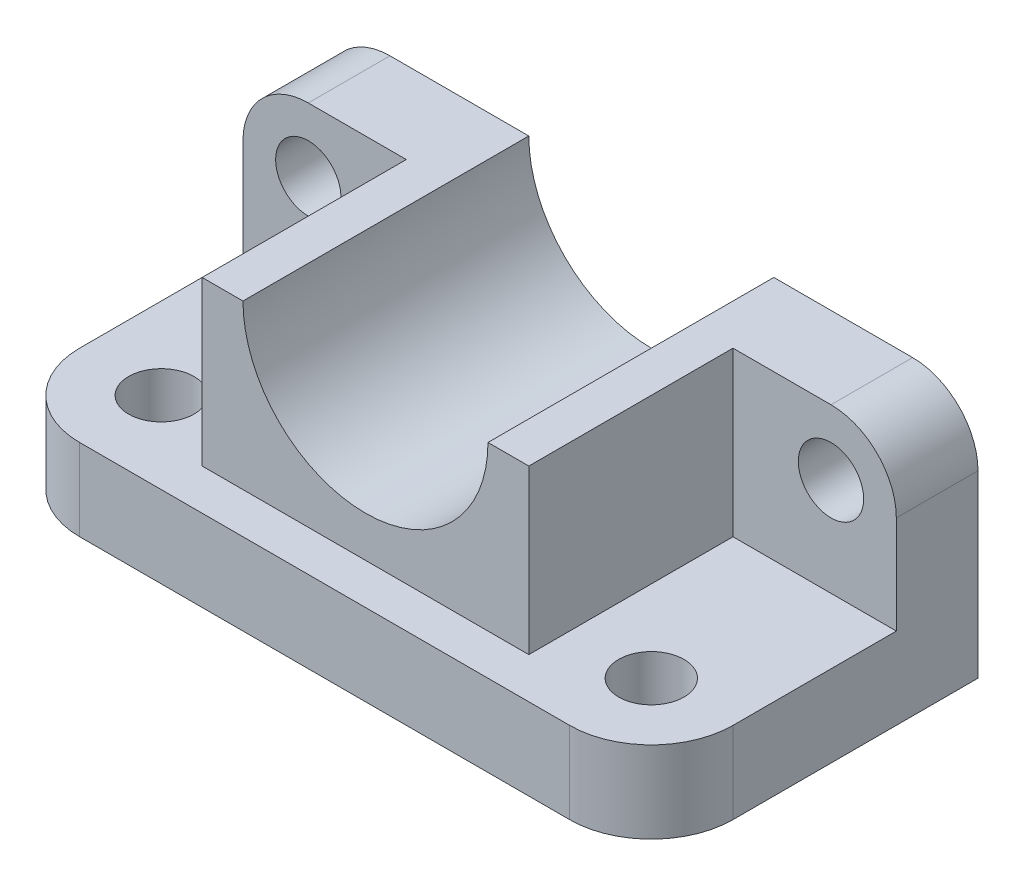
ISO-10303-21;
HEADER;
FILE_DESCRIPTION(('STEP AP214'),'2;1');
FILE_NAME('part.step','',(''),(''),'','','');
FILE_SCHEMA(('AUTOMOTIVE_DESIGN { 1 0 10303 214 1 1 1 1 }'));
ENDSEC;
DATA;
#1=APPLICATION_CONTEXT('core data for automotive mechanical design processes');
#2=APPLICATION_PROTOCOL_DEFINITION('international standard','automotive_design',2000,#1);
#3=PRODUCT_CONTEXT('',#1,'mechanical');
#4=PRODUCT('Part','Part','',(#3));
#5=PRODUCT_RELATED_PRODUCT_CATEGORY('part','',(#4));
#6=PRODUCT_DEFINITION_FORMATION('','',#4);
#7=PRODUCT_DEFINITION_CONTEXT('part definition',#1,'design');
#8=PRODUCT_DEFINITION('design','',#6,#7);
#9=PRODUCT_DEFINITION_SHAPE('','',#8);
#10=(LENGTH_UNIT() NAMED_UNIT(*) SI_UNIT(.MILLI.,.METRE.));
#11=(NAMED_UNIT(*) PLANE_ANGLE_UNIT() SI_UNIT($,.RADIAN.));
#12=(NAMED_UNIT(*) SI_UNIT($,.STERADIAN.) SOLID_ANGLE_UNIT());
#13=UNCERTAINTY_MEASURE_WITH_UNIT(LENGTH_MEASURE(1.E-05),#10,'distance_accuracy_value','');
#14=(GEOMETRIC_REPRESENTATION_CONTEXT(3) GLOBAL_UNCERTAINTY_ASSIGNED_CONTEXT((#13)) GLOBAL_UNIT_ASSIGNED_CONTEXT((#10,
#11,#12)) REPRESENTATION_CONTEXT('',''));
#15=CARTESIAN_POINT('',(0.,0.,0.));
#16=DIRECTION('',(0.,0.,1.));
#17=DIRECTION('',(1.,0.,0.));
#18=AXIS2_PLACEMENT_3D('',#15,#16,#17);
#19=CARTESIAN_POINT('',(0.,10.,0.));
#20=DIRECTION('',(0.,0.,-1.));
#21=DIRECTION('',(-1.,0.,0.));
#22=AXIS2_PLACEMENT_3D('',#19,#20,#21);
#23=PLANE('',#22);
#24=DIRECTION('',(1.,0.,0.));
#25=VECTOR('',#24,1.);
#26=CARTESIAN_POINT('',(0.,0.,0.));
#27=LINE('',#26,#25);
#28=CARTESIAN_POINT('',(-30.,0.,0.));
#29=VERTEX_POINT('',#28);
#30=CARTESIAN_POINT('',(30.,0.,0.));
#31=VERTEX_POINT('',#30);
#32=EDGE_CURVE('E262',#29,#31,#27,.T.);
#33=ORIENTED_EDGE('',*,*,#32,.T.);
#34=DIRECTION('',(0.,-1.,0.));
#35=VECTOR('',#34,1.);
#36=CARTESIAN_POINT('',(30.,10.,0.));
#37=LINE('',#36,#35);
#38=CARTESIAN_POINT('',(30.,10.,0.));
#39=VERTEX_POINT('',#38);
#40=EDGE_CURVE('E285',#31,#39,#37,.F.);
#41=ORIENTED_EDGE('',*,*,#40,.T.);
#42=DIRECTION('',(1.,0.,0.));
#43=VECTOR('',#42,1.);
#44=CARTESIAN_POINT('',(0.,10.,0.));
#45=LINE('',#44,#43);
#46=CARTESIAN_POINT('',(-30.,10.,0.));
#47=VERTEX_POINT('',#46);
#48=EDGE_CURVE('E268',#47,#39,#45,.T.);
#49=ORIENTED_EDGE('',*,*,#48,.F.);
#50=DIRECTION('',(0.,-1.,0.));
#51=VECTOR('',#50,1.);
#52=CARTESIAN_POINT('',(-30.,10.,0.));
#53=LINE('',#52,#51);
#54=EDGE_CURVE('E212',#29,#47,#53,.F.);
#55=ORIENTED_EDGE('',*,*,#54,.F.);
#56=EDGE_LOOP('',(#33,#41,#49,#55));
#57=FACE_BOUND('',#56,.T.);
#58=ADVANCED_FACE('F41',(#57),#23,.F.);
#59=CARTESIAN_POINT('',(40.,10.,0.));
#60=DIRECTION('',(-1.,0.,0.));
#61=DIRECTION('',(0.,0.,1.));
#62=AXIS2_PLACEMENT_3D('',#59,#60,#61);
#63=PLANE('',#62);
#64=DIRECTION('',(0.,-1.,0.));
#65=VECTOR('',#64,1.);
#66=CARTESIAN_POINT('',(40.,30.,-40.));
#67=LINE('',#66,#65);
#68=CARTESIAN_POINT('',(40.,22.,-40.));
#69=VERTEX_POINT('',#68);
#70=CARTESIAN_POINT('',(40.,0.,-40.));
#71=VERTEX_POINT('',#70);
#72=EDGE_CURVE('E250',#69,#71,#67,.T.);
#73=ORIENTED_EDGE('',*,*,#72,.F.);
#74=DIRECTION('',(0.,0.,-1.));
#75=VECTOR('',#74,1.);
#76=CARTESIAN_POINT('',(40.,22.,-30.));
#77=LINE('',#76,#75);
#78=CARTESIAN_POINT('',(40.,22.,-30.));
#79=VERTEX_POINT('',#78);
#80=EDGE_CURVE('E49',#69,#79,#77,.F.);
#81=ORIENTED_EDGE('',*,*,#80,.T.);
#82=DIRECTION('',(0.,-1.,0.));
#83=VECTOR('',#82,1.);
#84=CARTESIAN_POINT('',(40.,30.,-30.));
#85=LINE('',#84,#83);
#86=CARTESIAN_POINT('',(40.,10.,-30.));
#87=VERTEX_POINT('',#86);
#88=EDGE_CURVE('E254',#79,#87,#85,.T.);
#89=ORIENTED_EDGE('',*,*,#88,.T.);
#90=DIRECTION('',(0.,0.,-1.));
#91=VECTOR('',#90,1.);
#92=CARTESIAN_POINT('',(40.,10.,0.));
#93=LINE('',#92,#91);
#94=CARTESIAN_POINT('',(40.,10.,-10.));
#95=VERTEX_POINT('',#94);
#96=EDGE_CURVE('E271',#95,#87,#93,.T.);
#97=ORIENTED_EDGE('',*,*,#96,.F.);
#98=DIRECTION('',(0.,-1.,0.));
#99=VECTOR('',#98,1.);
#100=CARTESIAN_POINT('',(40.,10.,-10.));
#101=LINE('',#100,#99);
#102=CARTESIAN_POINT('',(40.,0.,-10.));
#103=VERTEX_POINT('',#102);
#104=EDGE_CURVE('E276',#95,#103,#101,.T.);
#105=ORIENTED_EDGE('',*,*,#104,.T.);
#106=DIRECTION('',(0.,0.,-1.));
#107=VECTOR('',#106,1.);
#108=CARTESIAN_POINT('',(40.,0.,0.));
#109=LINE('',#108,#107);
#110=EDGE_CURVE('E266',#103,#71,#109,.T.);
#111=ORIENTED_EDGE('',*,*,#110,.T.);
#112=EDGE_LOOP('',(#73,#81,#89,#97,#105,#111));
#113=FACE_BOUND('',#112,.T.);
#114=ADVANCED_FACE('F304',(#113),#63,.F.);
#115=CARTESIAN_POINT('',(0.,10.,0.));
#116=DIRECTION('',(0.,1.,0.));
#117=DIRECTION('',(0.,0.,1.));
#118=AXIS2_PLACEMENT_3D('',#115,#116,#117);
#119=PLANE('',#118);
#120=CARTESIAN_POINT('',(30.,10.,-10.));
#121=DIRECTION('',(0.,1.,0.));
#122=DIRECTION('',(0.,0.,1.));
#123=AXIS2_PLACEMENT_3D('',#120,#121,#122);
#124=CIRCLE('',#123,4.00000000000001);
#125=CARTESIAN_POINT('',(30.,10.,-5.99999999999999));
#126=VERTEX_POINT('',#125);
#127=EDGE_CURVE('E230',#126,#126,#124,.T.);
#128=ORIENTED_EDGE('',*,*,#127,.F.);
#129=EDGE_LOOP('',(#128));
#130=FACE_BOUND('',#129,.T.);
#131=ORIENTED_EDGE('',*,*,#48,.T.);
#132=CARTESIAN_POINT('',(30.,10.,-10.));
#133=DIRECTION('',(0.,1.,0.));
#134=DIRECTION('',(0.,0.,1.));
#135=AXIS2_PLACEMENT_3D('',#132,#133,#134);
#136=CIRCLE('',#135,10.);
#137=EDGE_CURVE('E287',#39,#95,#136,.T.);
#138=ORIENTED_EDGE('',*,*,#137,.T.);
#139=ORIENTED_EDGE('',*,*,#96,.T.);
#140=DIRECTION('',(-1.,0.,0.));
#141=VECTOR('',#140,1.);
#142=CARTESIAN_POINT('',(0.,10.,-30.));
#143=LINE('',#142,#141);
#144=CARTESIAN_POINT('',(20.,10.,-30.));
#145=VERTEX_POINT('',#144);
#146=EDGE_CURVE('E274',#87,#145,#143,.T.);
#147=ORIENTED_EDGE('',*,*,#146,.T.);
#148=DIRECTION('',(0.,0.,1.));
#149=VECTOR('',#148,1.);
#150=CARTESIAN_POINT('',(20.,10.,0.));
#151=LINE('',#150,#149);
#152=CARTESIAN_POINT('',(20.,10.,-5.));
#153=VERTEX_POINT('',#152);
#154=EDGE_CURVE('E263',#145,#153,#151,.T.);
#155=ORIENTED_EDGE('',*,*,#154,.T.);
#156=DIRECTION('',(-1.,0.,0.));
#157=VECTOR('',#156,1.);
#158=CARTESIAN_POINT('',(0.,10.,-5.));
#159=LINE('',#158,#157);
#160=CARTESIAN_POINT('',(-20.,10.,-5.));
#161=VERTEX_POINT('',#160);
#162=EDGE_CURVE('E265',#153,#161,#159,.T.);
#163=ORIENTED_EDGE('',*,*,#162,.T.);
#164=DIRECTION('',(0.,0.,1.));
#165=VECTOR('',#164,1.);
#166=CARTESIAN_POINT('',(-20.,10.,0.));
#167=LINE('',#166,#165);
#168=CARTESIAN_POINT('',(-20.,10.,-30.));
#169=VERTEX_POINT('',#168);
#170=EDGE_CURVE('E195',#169,#161,#167,.T.);
#171=ORIENTED_EDGE('',*,*,#170,.F.);
#172=DIRECTION('',(1.,0.,0.));
#173=VECTOR('',#172,1.);
#174=CARTESIAN_POINT('',(0.,10.,-30.));
#175=LINE('',#174,#173);
#176=CARTESIAN_POINT('',(-40.,10.,-30.));
#177=VERTEX_POINT('',#176);
#178=EDGE_CURVE('E201',#177,#169,#175,.T.);
#179=ORIENTED_EDGE('',*,*,#178,.F.);
#180=DIRECTION('',(0.,0.,-1.));
#181=VECTOR('',#180,1.);
#182=CARTESIAN_POINT('',(-40.,10.,0.));
#183=LINE('',#182,#181);
#184=CARTESIAN_POINT('',(-40.,10.,-10.));
#185=VERTEX_POINT('',#184);
#186=EDGE_CURVE('E198',#185,#177,#183,.T.);
#187=ORIENTED_EDGE('',*,*,#186,.F.);
#188=CARTESIAN_POINT('',(-30.,10.,-10.));
#189=DIRECTION('',(0.,-1.,0.));
#190=DIRECTION('',(0.,0.,1.));
#191=AXIS2_PLACEMENT_3D('',#188,#189,#190);
#192=CIRCLE('',#191,10.);
#193=EDGE_CURVE('E215',#47,#185,#192,.T.);
#194=ORIENTED_EDGE('',*,*,#193,.F.);
#195=EDGE_LOOP('',(#131,#138,#139,#147,#155,#163,#171,#179,#187,#194));
#196=FACE_BOUND('',#195,.T.);
#197=CARTESIAN_POINT('',(-30.,10.,-10.));
#198=DIRECTION('',(0.,-1.,0.));
#199=DIRECTION('',(0.,0.,1.));
#200=AXIS2_PLACEMENT_3D('',#197,#198,#199);
#201=CIRCLE('',#200,4.00000000000001);
#202=CARTESIAN_POINT('',(-30.,10.,-5.99999999999999));
#203=VERTEX_POINT('',#202);
#204=EDGE_CURVE('E340',#203,#203,#201,.T.);
#205=ORIENTED_EDGE('',*,*,#204,.T.);
#206=EDGE_LOOP('',(#205));
#207=FACE_BOUND('',#206,.T.);
#208=ADVANCED_FACE('F307',(#130,#196,#207),#119,.T.);
#209=CARTESIAN_POINT('',(0.,0.,0.));
#210=DIRECTION('',(0.,1.,0.));
#211=DIRECTION('',(0.,0.,1.));
#212=AXIS2_PLACEMENT_3D('',#209,#210,#211);
#213=PLANE('',#212);
#214=CARTESIAN_POINT('',(30.,0.,-10.));
#215=DIRECTION('',(0.,1.,0.));
#216=DIRECTION('',(0.,0.,1.));
#217=AXIS2_PLACEMENT_3D('',#214,#215,#216);
#218=CIRCLE('',#217,4.00000000000001);
#219=CARTESIAN_POINT('',(30.,0.,-5.99999999999999));
#220=VERTEX_POINT('',#219);
#221=EDGE_CURVE('E162',#220,#220,#218,.F.);
#222=ORIENTED_EDGE('',*,*,#221,.F.);
#223=EDGE_LOOP('',(#222));
#224=FACE_BOUND('',#223,.T.);
#225=ORIENTED_EDGE('',*,*,#110,.F.);
#226=CARTESIAN_POINT('',(30.,0.,-10.));
#227=DIRECTION('',(0.,1.,0.));
#228=DIRECTION('',(0.,0.,1.));
#229=AXIS2_PLACEMENT_3D('',#226,#227,#228);
#230=CIRCLE('',#229,10.);
#231=EDGE_CURVE('E283',#103,#31,#230,.F.);
#232=ORIENTED_EDGE('',*,*,#231,.T.);
#233=ORIENTED_EDGE('',*,*,#32,.F.);
#234=CARTESIAN_POINT('',(-30.,0.,-10.));
#235=DIRECTION('',(0.,-1.,0.));
#236=DIRECTION('',(0.,0.,1.));
#237=AXIS2_PLACEMENT_3D('',#234,#235,#236);
#238=CIRCLE('',#237,10.);
#239=CARTESIAN_POINT('',(-40.,0.,-10.));
#240=VERTEX_POINT('',#239);
#241=EDGE_CURVE('E209',#240,#29,#238,.F.);
#242=ORIENTED_EDGE('',*,*,#241,.F.);
#243=DIRECTION('',(0.,0.,-1.));
#244=VECTOR('',#243,1.);
#245=CARTESIAN_POINT('',(-40.,0.,0.));
#246=LINE('',#245,#244);
#247=CARTESIAN_POINT('',(-40.,0.,-40.));
#248=VERTEX_POINT('',#247);
#249=EDGE_CURVE('E194',#240,#248,#246,.T.);
#250=ORIENTED_EDGE('',*,*,#249,.T.);
#251=DIRECTION('',(1.,0.,0.));
#252=VECTOR('',#251,1.);
#253=CARTESIAN_POINT('',(0.,0.,-40.));
#254=LINE('',#253,#252);
#255=EDGE_CURVE('E239',#248,#71,#254,.T.);
#256=ORIENTED_EDGE('',*,*,#255,.T.);
#257=EDGE_LOOP('',(#225,#232,#233,#242,#250,#256));
#258=FACE_BOUND('',#257,.T.);
#259=CARTESIAN_POINT('',(-30.,0.,-10.));
#260=DIRECTION('',(0.,-1.,0.));
#261=DIRECTION('',(0.,0.,1.));
#262=AXIS2_PLACEMENT_3D('',#259,#260,#261);
#263=CIRCLE('',#262,4.00000000000001);
#264=CARTESIAN_POINT('',(-30.,0.,-5.99999999999999));
#265=VERTEX_POINT('',#264);
#266=EDGE_CURVE('E170',#265,#265,#263,.F.);
#267=ORIENTED_EDGE('',*,*,#266,.T.);
#268=EDGE_LOOP('',(#267));
#269=FACE_BOUND('',#268,.T.);
#270=ADVANCED_FACE('F317',(#224,#258,#269),#213,.F.);
#271=CARTESIAN_POINT('',(0.,30.,-5.));
#272=DIRECTION('',(0.,0.,1.));
#273=DIRECTION('',(1.,0.,0.));
#274=AXIS2_PLACEMENT_3D('',#271,#272,#273);
#275=PLANE('',#274);
#276=CARTESIAN_POINT('',(0.,30.,-5.));
#277=DIRECTION('',(0.,0.,1.));
#278=DIRECTION('',(-1.,0.,0.));
#279=AXIS2_PLACEMENT_3D('',#276,#277,#278);
#280=CIRCLE('',#279,15.);
#281=CARTESIAN_POINT('',(-15.,30.,-5.));
#282=VERTEX_POINT('',#281);
#283=CARTESIAN_POINT('',(15.,30.,-5.));
#284=VERTEX_POINT('',#283);
#285=EDGE_CURVE('E161',#282,#284,#280,.T.);
#286=ORIENTED_EDGE('',*,*,#285,.F.);
#287=DIRECTION('',(1.,0.,0.));
#288=VECTOR('',#287,1.);
#289=CARTESIAN_POINT('',(0.,30.,-5.));
#290=LINE('',#289,#288);
#291=CARTESIAN_POINT('',(-20.,30.,-5.));
#292=VERTEX_POINT('',#291);
#293=EDGE_CURVE('E169',#292,#282,#290,.T.);
#294=ORIENTED_EDGE('',*,*,#293,.F.);
#295=DIRECTION('',(0.,-1.,0.));
#296=VECTOR('',#295,1.);
#297=CARTESIAN_POINT('',(-20.,30.,-5.));
#298=LINE('',#297,#296);
#299=EDGE_CURVE('E191',#292,#161,#298,.T.);
#300=ORIENTED_EDGE('',*,*,#299,.T.);
#301=ORIENTED_EDGE('',*,*,#162,.F.);
#302=DIRECTION('',(0.,-1.,0.));
#303=VECTOR('',#302,1.);
#304=CARTESIAN_POINT('',(20.,30.,-5.));
#305=LINE('',#304,#303);
#306=CARTESIAN_POINT('',(20.,30.,-5.));
#307=VERTEX_POINT('',#306);
#308=EDGE_CURVE('E259',#307,#153,#305,.T.);
#309=ORIENTED_EDGE('',*,*,#308,.F.);
#310=DIRECTION('',(-1.,0.,0.));
#311=VECTOR('',#310,1.);
#312=CARTESIAN_POINT('',(0.,30.,-5.));
#313=LINE('',#312,#311);
#314=EDGE_CURVE('E240',#307,#284,#313,.T.);
#315=ORIENTED_EDGE('',*,*,#314,.T.);
#316=EDGE_LOOP('',(#286,#294,#300,#301,#309,#315));
#317=FACE_BOUND('',#316,.T.);
#318=ADVANCED_FACE('F400',(#317),#275,.T.);
#319=CARTESIAN_POINT('',(20.,30.,0.));
#320=DIRECTION('',(1.,0.,0.));
#321=DIRECTION('',(0.,0.,-1.));
#322=AXIS2_PLACEMENT_3D('',#319,#320,#321);
#323=PLANE('',#322);
#324=ORIENTED_EDGE('',*,*,#308,.T.);
#325=ORIENTED_EDGE('',*,*,#154,.F.);
#326=DIRECTION('',(0.,-1.,0.));
#327=VECTOR('',#326,1.);
#328=CARTESIAN_POINT('',(20.,30.,-30.));
#329=LINE('',#328,#327);
#330=CARTESIAN_POINT('',(20.,30.,-30.));
#331=VERTEX_POINT('',#330);
#332=EDGE_CURVE('E256',#331,#145,#329,.T.);
#333=ORIENTED_EDGE('',*,*,#332,.F.);
#334=DIRECTION('',(0.,0.,1.));
#335=VECTOR('',#334,1.);
#336=CARTESIAN_POINT('',(20.,30.,0.));
#337=LINE('',#336,#335);
#338=EDGE_CURVE('E243',#331,#307,#337,.T.);
#339=ORIENTED_EDGE('',*,*,#338,.T.);
#340=EDGE_LOOP('',(#324,#325,#333,#339));
#341=FACE_BOUND('',#340,.T.);
#342=ADVANCED_FACE('F396',(#341),#323,.T.);
#343=CARTESIAN_POINT('',(0.,30.,-30.));
#344=DIRECTION('',(0.,0.,1.));
#345=DIRECTION('',(1.,0.,0.));
#346=AXIS2_PLACEMENT_3D('',#343,#344,#345);
#347=PLANE('',#346);
#348=CARTESIAN_POINT('',(32.,22.,-30.));
#349=DIRECTION('',(0.,0.,1.));
#350=DIRECTION('',(1.,0.,0.));
#351=AXIS2_PLACEMENT_3D('',#348,#349,#350);
#352=CIRCLE('',#351,4.);
#353=CARTESIAN_POINT('',(36.,22.,-30.));
#354=VERTEX_POINT('',#353);
#355=EDGE_CURVE('E227',#354,#354,#352,.T.);
#356=ORIENTED_EDGE('',*,*,#355,.F.);
#357=EDGE_LOOP('',(#356));
#358=FACE_BOUND('',#357,.T.);
#359=ORIENTED_EDGE('',*,*,#88,.F.);
#360=CARTESIAN_POINT('',(32.,22.,-30.));
#361=DIRECTION('',(0.,0.,1.));
#362=DIRECTION('',(1.,0.,0.));
#363=AXIS2_PLACEMENT_3D('',#360,#361,#362);
#364=CIRCLE('',#363,8.);
#365=CARTESIAN_POINT('',(32.,30.,-30.));
#366=VERTEX_POINT('',#365);
#367=EDGE_CURVE('E11',#79,#366,#364,.T.);
#368=ORIENTED_EDGE('',*,*,#367,.T.);
#369=DIRECTION('',(-1.,0.,0.));
#370=VECTOR('',#369,1.);
#371=CARTESIAN_POINT('',(0.,30.,-30.));
#372=LINE('',#371,#370);
#373=EDGE_CURVE('E246',#366,#331,#372,.T.);
#374=ORIENTED_EDGE('',*,*,#373,.T.);
#375=ORIENTED_EDGE('',*,*,#332,.T.);
#376=ORIENTED_EDGE('',*,*,#146,.F.);
#377=EDGE_LOOP('',(#359,#368,#374,#375,#376));
#378=FACE_BOUND('',#377,.T.);
#379=ADVANCED_FACE('F300',(#358,#378),#347,.T.);
#380=CARTESIAN_POINT('',(0.,30.,-40.));
#381=DIRECTION('',(0.,0.,-1.));
#382=DIRECTION('',(-1.,0.,0.));
#383=AXIS2_PLACEMENT_3D('',#380,#381,#382);
#384=PLANE('',#383);
#385=CARTESIAN_POINT('',(32.,22.,-40.));
#386=DIRECTION('',(0.,0.,-1.));
#387=DIRECTION('',(-1.,0.,0.));
#388=AXIS2_PLACEMENT_3D('',#385,#386,#387);
#389=CIRCLE('',#388,4.);
#390=CARTESIAN_POINT('',(28.,22.,-40.));
#391=VERTEX_POINT('',#390);
#392=EDGE_CURVE('E226',#391,#391,#389,.F.);
#393=ORIENTED_EDGE('',*,*,#392,.T.);
#394=EDGE_LOOP('',(#393));
#395=FACE_BOUND('',#394,.T.);
#396=DIRECTION('',(1.,0.,0.));
#397=VECTOR('',#396,1.);
#398=CARTESIAN_POINT('',(0.,30.,-40.));
#399=LINE('',#398,#397);
#400=CARTESIAN_POINT('',(15.,30.,-40.));
#401=VERTEX_POINT('',#400);
#402=CARTESIAN_POINT('',(32.,30.,-40.));
#403=VERTEX_POINT('',#402);
#404=EDGE_CURVE('E248',#401,#403,#399,.T.);
#405=ORIENTED_EDGE('',*,*,#404,.T.);
#406=CARTESIAN_POINT('',(32.,22.,-40.));
#407=DIRECTION('',(0.,0.,-1.));
#408=DIRECTION('',(-1.,0.,0.));
#409=AXIS2_PLACEMENT_3D('',#406,#407,#408);
#410=CIRCLE('',#409,8.);
#411=EDGE_CURVE('E63',#403,#69,#410,.T.);
#412=ORIENTED_EDGE('',*,*,#411,.T.);
#413=ORIENTED_EDGE('',*,*,#72,.T.);
#414=ORIENTED_EDGE('',*,*,#255,.F.);
#415=DIRECTION('',(0.,-1.,0.));
#416=VECTOR('',#415,1.);
#417=CARTESIAN_POINT('',(-40.,30.,-40.));
#418=LINE('',#417,#416);
#419=CARTESIAN_POINT('',(-40.,22.,-40.));
#420=VERTEX_POINT('',#419);
#421=EDGE_CURVE('E177',#420,#248,#418,.T.);
#422=ORIENTED_EDGE('',*,*,#421,.F.);
#423=CARTESIAN_POINT('',(-32.,22.,-40.));
#424=DIRECTION('',(0.,0.,1.));
#425=DIRECTION('',(1.,0.,0.));
#426=AXIS2_PLACEMENT_3D('',#423,#424,#425);
#427=CIRCLE('',#426,8.);
#428=CARTESIAN_POINT('',(-32.,30.,-40.));
#429=VERTEX_POINT('',#428);
#430=EDGE_CURVE('E176',#429,#420,#427,.T.);
#431=ORIENTED_EDGE('',*,*,#430,.F.);
#432=DIRECTION('',(-1.,0.,0.));
#433=VECTOR('',#432,1.);
#434=CARTESIAN_POINT('',(0.,30.,-40.));
#435=LINE('',#434,#433);
#436=CARTESIAN_POINT('',(-15.,30.,-40.));
#437=VERTEX_POINT('',#436);
#438=EDGE_CURVE('E167',#437,#429,#435,.T.);
#439=ORIENTED_EDGE('',*,*,#438,.F.);
#440=CARTESIAN_POINT('',(0.,30.,-40.));
#441=DIRECTION('',(0.,0.,-1.));
#442=DIRECTION('',(-1.,0.,0.));
#443=AXIS2_PLACEMENT_3D('',#440,#441,#442);
#444=CIRCLE('',#443,15.);
#445=EDGE_CURVE('E152',#437,#401,#444,.F.);
#446=ORIENTED_EDGE('',*,*,#445,.T.);
#447=EDGE_LOOP('',(#405,#412,#413,#414,#422,#431,#439,#446));
#448=FACE_BOUND('',#447,.T.);
#449=CARTESIAN_POINT('',(-32.,22.,-40.));
#450=DIRECTION('',(0.,0.,1.));
#451=DIRECTION('',(1.,0.,0.));
#452=AXIS2_PLACEMENT_3D('',#449,#450,#451);
#453=CIRCLE('',#452,4.);
#454=CARTESIAN_POINT('',(-28.,22.,-40.));
#455=VERTEX_POINT('',#454);
#456=EDGE_CURVE('E344',#455,#455,#453,.F.);
#457=ORIENTED_EDGE('',*,*,#456,.F.);
#458=EDGE_LOOP('',(#457));
#459=FACE_BOUND('',#458,.T.);
#460=ADVANCED_FACE('F173',(#395,#448,#459),#384,.T.);
#461=CARTESIAN_POINT('',(0.,30.,0.));
#462=DIRECTION('',(0.,1.,0.));
#463=DIRECTION('',(0.,0.,1.));
#464=AXIS2_PLACEMENT_3D('',#461,#462,#463);
#465=PLANE('',#464);
#466=ORIENTED_EDGE('',*,*,#373,.F.);
#467=DIRECTION('',(0.,0.,-1.));
#468=VECTOR('',#467,1.);
#469=CARTESIAN_POINT('',(32.,30.,-40.));
#470=LINE('',#469,#468);
#471=EDGE_CURVE('E289',#366,#403,#470,.T.);
#472=ORIENTED_EDGE('',*,*,#471,.T.);
#473=ORIENTED_EDGE('',*,*,#404,.F.);
#474=DIRECTION('',(0.,0.,1.));
#475=VECTOR('',#474,1.);
#476=CARTESIAN_POINT('',(15.,30.,-40.001));
#477=LINE('',#476,#475);
#478=EDGE_CURVE('E158',#401,#284,#477,.T.);
#479=ORIENTED_EDGE('',*,*,#478,.T.);
#480=ORIENTED_EDGE('',*,*,#314,.F.);
#481=ORIENTED_EDGE('',*,*,#338,.F.);
#482=EDGE_LOOP('',(#466,#472,#473,#479,#480,#481));
#483=FACE_BOUND('',#482,.T.);
#484=ADVANCED_FACE('F295',(#483),#465,.T.);
#485=CARTESIAN_POINT('',(0.,30.,-40.001));
#486=DIRECTION('',(0.,0.,1.));
#487=DIRECTION('',(1.,0.,0.));
#488=AXIS2_PLACEMENT_3D('',#485,#486,#487);
#489=CYLINDRICAL_SURFACE('',#488,15.);
#490=ORIENTED_EDGE('',*,*,#445,.F.);
#491=DIRECTION('',(0.,0.,1.));
#492=VECTOR('',#491,1.);
#493=CARTESIAN_POINT('',(-15.,30.,-40.001));
#494=LINE('',#493,#492);
#495=EDGE_CURVE('E155',#437,#282,#494,.T.);
#496=ORIENTED_EDGE('',*,*,#495,.T.);
#497=ORIENTED_EDGE('',*,*,#285,.T.);
#498=ORIENTED_EDGE('',*,*,#478,.F.);
#499=EDGE_LOOP('',(#490,#496,#497,#498));
#500=FACE_BOUND('',#499,.T.);
#501=ADVANCED_FACE('F154',(#500),#489,.F.);
#502=CARTESIAN_POINT('',(30.,-0.000999999999999265,-10.));
#503=DIRECTION('',(0.,1.,0.));
#504=DIRECTION('',(0.,0.,1.));
#505=AXIS2_PLACEMENT_3D('',#502,#503,#504);
#506=CYLINDRICAL_SURFACE('',#505,4.00000000000001);
#507=ORIENTED_EDGE('',*,*,#127,.T.);
#508=EDGE_LOOP('',(#507));
#509=FACE_BOUND('',#508,.T.);
#510=ORIENTED_EDGE('',*,*,#221,.T.);
#511=EDGE_LOOP('',(#510));
#512=FACE_BOUND('',#511,.T.);
#513=ADVANCED_FACE('F372',(#509,#512),#506,.F.);
#514=CARTESIAN_POINT('',(30.,10.,-10.));
#515=DIRECTION('',(0.,-1.,0.));
#516=DIRECTION('',(0.,0.,-1.));
#517=AXIS2_PLACEMENT_3D('',#514,#515,#516);
#518=CYLINDRICAL_SURFACE('',#517,10.);
#519=ORIENTED_EDGE('',*,*,#137,.F.);
#520=ORIENTED_EDGE('',*,*,#40,.F.);
#521=ORIENTED_EDGE('',*,*,#231,.F.);
#522=ORIENTED_EDGE('',*,*,#104,.F.);
#523=EDGE_LOOP('',(#519,#520,#521,#522));
#524=FACE_BOUND('',#523,.T.);
#525=ADVANCED_FACE('F314',(#524),#518,.T.);
#526=CARTESIAN_POINT('',(32.,22.,0.));
#527=DIRECTION('',(0.,0.,1.));
#528=DIRECTION('',(1.,0.,0.));
#529=AXIS2_PLACEMENT_3D('',#526,#527,#528);
#530=CYLINDRICAL_SURFACE('',#529,8.);
#531=ORIENTED_EDGE('',*,*,#367,.F.);
#532=ORIENTED_EDGE('',*,*,#80,.F.);
#533=ORIENTED_EDGE('',*,*,#411,.F.);
#534=ORIENTED_EDGE('',*,*,#471,.F.);
#535=EDGE_LOOP('',(#531,#532,#533,#534));
#536=FACE_BOUND('',#535,.T.);
#537=ADVANCED_FACE('F43',(#536),#530,.T.);
#538=CARTESIAN_POINT('',(32.,22.,-40.001));
#539=DIRECTION('',(0.,0.,1.));
#540=DIRECTION('',(1.,0.,0.));
#541=AXIS2_PLACEMENT_3D('',#538,#539,#540);
#542=CYLINDRICAL_SURFACE('',#541,4.);
#543=ORIENTED_EDGE('',*,*,#392,.F.);
#544=EDGE_LOOP('',(#543));
#545=FACE_BOUND('',#544,.T.);
#546=ORIENTED_EDGE('',*,*,#355,.T.);
#547=EDGE_LOOP('',(#546));
#548=FACE_BOUND('',#547,.T.);
#549=ADVANCED_FACE('F377',(#545,#548),#542,.F.);
#550=CARTESIAN_POINT('',(-40.,10.,0.));
#551=DIRECTION('',(1.,0.,0.));
#552=DIRECTION('',(0.,0.,1.));
#553=AXIS2_PLACEMENT_3D('',#550,#551,#552);
#554=PLANE('',#553);
#555=ORIENTED_EDGE('',*,*,#421,.T.);
#556=ORIENTED_EDGE('',*,*,#249,.F.);
#557=DIRECTION('',(0.,-1.,0.));
#558=VECTOR('',#557,1.);
#559=CARTESIAN_POINT('',(-40.,10.,-10.));
#560=LINE('',#559,#558);
#561=EDGE_CURVE('E204',#185,#240,#560,.T.);
#562=ORIENTED_EDGE('',*,*,#561,.F.);
#563=ORIENTED_EDGE('',*,*,#186,.T.);
#564=DIRECTION('',(0.,-1.,0.));
#565=VECTOR('',#564,1.);
#566=CARTESIAN_POINT('',(-40.,30.,-30.));
#567=LINE('',#566,#565);
#568=CARTESIAN_POINT('',(-40.,22.,-30.));
#569=VERTEX_POINT('',#568);
#570=EDGE_CURVE('E181',#569,#177,#567,.T.);
#571=ORIENTED_EDGE('',*,*,#570,.F.);
#572=DIRECTION('',(0.,0.,-1.));
#573=VECTOR('',#572,1.);
#574=CARTESIAN_POINT('',(-40.,22.,-30.));
#575=LINE('',#574,#573);
#576=EDGE_CURVE('E220',#420,#569,#575,.F.);
#577=ORIENTED_EDGE('',*,*,#576,.F.);
#578=EDGE_LOOP('',(#555,#556,#562,#563,#571,#577));
#579=FACE_BOUND('',#578,.T.);
#580=ADVANCED_FACE('F322',(#579),#554,.F.);
#581=CARTESIAN_POINT('',(-20.,30.,0.));
#582=DIRECTION('',(-1.,0.,0.));
#583=DIRECTION('',(0.,0.,-1.));
#584=AXIS2_PLACEMENT_3D('',#581,#582,#583);
#585=PLANE('',#584);
#586=ORIENTED_EDGE('',*,*,#299,.F.);
#587=DIRECTION('',(0.,0.,1.));
#588=VECTOR('',#587,1.);
#589=CARTESIAN_POINT('',(-20.,30.,0.));
#590=LINE('',#589,#588);
#591=CARTESIAN_POINT('',(-20.,30.,-30.));
#592=VERTEX_POINT('',#591);
#593=EDGE_CURVE('E183',#592,#292,#590,.T.);
#594=ORIENTED_EDGE('',*,*,#593,.F.);
#595=DIRECTION('',(0.,-1.,0.));
#596=VECTOR('',#595,1.);
#597=CARTESIAN_POINT('',(-20.,30.,-30.));
#598=LINE('',#597,#596);
#599=EDGE_CURVE('E189',#592,#169,#598,.T.);
#600=ORIENTED_EDGE('',*,*,#599,.T.);
#601=ORIENTED_EDGE('',*,*,#170,.T.);
#602=EDGE_LOOP('',(#586,#594,#600,#601));
#603=FACE_BOUND('',#602,.T.);
#604=ADVANCED_FACE('F335',(#603),#585,.T.);
#605=CARTESIAN_POINT('',(0.,30.,-30.));
#606=DIRECTION('',(0.,0.,1.));
#607=DIRECTION('',(-1.,0.,0.));
#608=AXIS2_PLACEMENT_3D('',#605,#606,#607);
#609=PLANE('',#608);
#610=CARTESIAN_POINT('',(-32.,22.,-30.));
#611=DIRECTION('',(0.,0.,-1.));
#612=DIRECTION('',(-1.,0.,0.));
#613=AXIS2_PLACEMENT_3D('',#610,#611,#612);
#614=CIRCLE('',#613,4.);
#615=CARTESIAN_POINT('',(-36.,22.,-30.));
#616=VERTEX_POINT('',#615);
#617=EDGE_CURVE('E343',#616,#616,#614,.T.);
#618=ORIENTED_EDGE('',*,*,#617,.T.);
#619=EDGE_LOOP('',(#618));
#620=FACE_BOUND('',#619,.T.);
#621=ORIENTED_EDGE('',*,*,#570,.T.);
#622=ORIENTED_EDGE('',*,*,#178,.T.);
#623=ORIENTED_EDGE('',*,*,#599,.F.);
#624=DIRECTION('',(1.,0.,0.));
#625=VECTOR('',#624,1.);
#626=CARTESIAN_POINT('',(0.,30.,-30.));
#627=LINE('',#626,#625);
#628=CARTESIAN_POINT('',(-32.,30.,-30.));
#629=VERTEX_POINT('',#628);
#630=EDGE_CURVE('E178',#629,#592,#627,.T.);
#631=ORIENTED_EDGE('',*,*,#630,.F.);
#632=CARTESIAN_POINT('',(-32.,22.,-30.));
#633=DIRECTION('',(0.,0.,-1.));
#634=DIRECTION('',(-1.,0.,0.));
#635=AXIS2_PLACEMENT_3D('',#632,#633,#634);
#636=CIRCLE('',#635,8.);
#637=EDGE_CURVE('E223',#569,#629,#636,.T.);
#638=ORIENTED_EDGE('',*,*,#637,.F.);
#639=EDGE_LOOP('',(#621,#622,#623,#631,#638));
#640=FACE_BOUND('',#639,.T.);
#641=ADVANCED_FACE('F332',(#620,#640),#609,.T.);
#642=CARTESIAN_POINT('',(0.,30.,0.));
#643=DIRECTION('',(0.,1.,0.));
#644=DIRECTION('',(0.,0.,1.));
#645=AXIS2_PLACEMENT_3D('',#642,#643,#644);
#646=PLANE('',#645);
#647=ORIENTED_EDGE('',*,*,#630,.T.);
#648=ORIENTED_EDGE('',*,*,#593,.T.);
#649=ORIENTED_EDGE('',*,*,#293,.T.);
#650=ORIENTED_EDGE('',*,*,#495,.F.);
#651=ORIENTED_EDGE('',*,*,#438,.T.);
#652=DIRECTION('',(0.,0.,-1.));
#653=VECTOR('',#652,1.);
#654=CARTESIAN_POINT('',(-32.,30.,-40.));
#655=LINE('',#654,#653);
#656=EDGE_CURVE('E217',#629,#429,#655,.T.);
#657=ORIENTED_EDGE('',*,*,#656,.F.);
#658=EDGE_LOOP('',(#647,#648,#649,#650,#651,#657));
#659=FACE_BOUND('',#658,.T.);
#660=ADVANCED_FACE('F166',(#659),#646,.T.);
#661=CARTESIAN_POINT('',(-30.,-0.000999999999999265,-10.));
#662=DIRECTION('',(0.,1.,0.));
#663=DIRECTION('',(0.,0.,1.));
#664=AXIS2_PLACEMENT_3D('',#661,#662,#663);
#665=CYLINDRICAL_SURFACE('',#664,4.00000000000001);
#666=ORIENTED_EDGE('',*,*,#204,.F.);
#667=EDGE_LOOP('',(#666));
#668=FACE_BOUND('',#667,.T.);
#669=ORIENTED_EDGE('',*,*,#266,.F.);
#670=EDGE_LOOP('',(#669));
#671=FACE_BOUND('',#670,.T.);
#672=ADVANCED_FACE('F455',(#668,#671),#665,.F.);
#673=CARTESIAN_POINT('',(-30.,10.,-10.));
#674=DIRECTION('',(0.,-1.,0.));
#675=DIRECTION('',(0.,0.,-1.));
#676=AXIS2_PLACEMENT_3D('',#673,#674,#675);
#677=CYLINDRICAL_SURFACE('',#676,10.);
#678=ORIENTED_EDGE('',*,*,#193,.T.);
#679=ORIENTED_EDGE('',*,*,#561,.T.);
#680=ORIENTED_EDGE('',*,*,#241,.T.);
#681=ORIENTED_EDGE('',*,*,#54,.T.);
#682=EDGE_LOOP('',(#678,#679,#680,#681));
#683=FACE_BOUND('',#682,.T.);
#684=ADVANCED_FACE('F358',(#683),#677,.T.);
#685=CARTESIAN_POINT('',(-32.,22.,0.));
#686=DIRECTION('',(0.,0.,1.));
#687=DIRECTION('',(-1.,0.,0.));
#688=AXIS2_PLACEMENT_3D('',#685,#686,#687);
#689=CYLINDRICAL_SURFACE('',#688,8.);
#690=ORIENTED_EDGE('',*,*,#637,.T.);
#691=ORIENTED_EDGE('',*,*,#656,.T.);
#692=ORIENTED_EDGE('',*,*,#430,.T.);
#693=ORIENTED_EDGE('',*,*,#576,.T.);
#694=EDGE_LOOP('',(#690,#691,#692,#693));
#695=FACE_BOUND('',#694,.T.);
#696=ADVANCED_FACE('F326',(#695),#689,.T.);
#697=CARTESIAN_POINT('',(-32.,22.,-40.001));
#698=DIRECTION('',(0.,0.,1.));
#699=DIRECTION('',(-1.,0.,0.));
#700=AXIS2_PLACEMENT_3D('',#697,#698,#699);
#701=CYLINDRICAL_SURFACE('',#700,4.);
#702=ORIENTED_EDGE('',*,*,#456,.T.);
#703=EDGE_LOOP('',(#702));
#704=FACE_BOUND('',#703,.T.);
#705=ORIENTED_EDGE('',*,*,#617,.F.);
#706=EDGE_LOOP('',(#705));
#707=FACE_BOUND('',#706,.T.);
#708=ADVANCED_FACE('F351',(#704,#707),#701,.F.);
#709=CLOSED_SHELL('',(#58,#114,#208,#270,#318,#342,#379,#460,#484,#501,#513,#525,#537,#549,#580,
#604,#641,#660,#672,#684,#696,#708));
#710=MANIFOLD_SOLID_BREP('B2',#709);
#711=ADVANCED_BREP_SHAPE_REPRESENTATION('',(#18,#710),#14);
#712=SHAPE_DEFINITION_REPRESENTATION(#9,#711);
ENDSEC;
END-ISO-10303-21;
